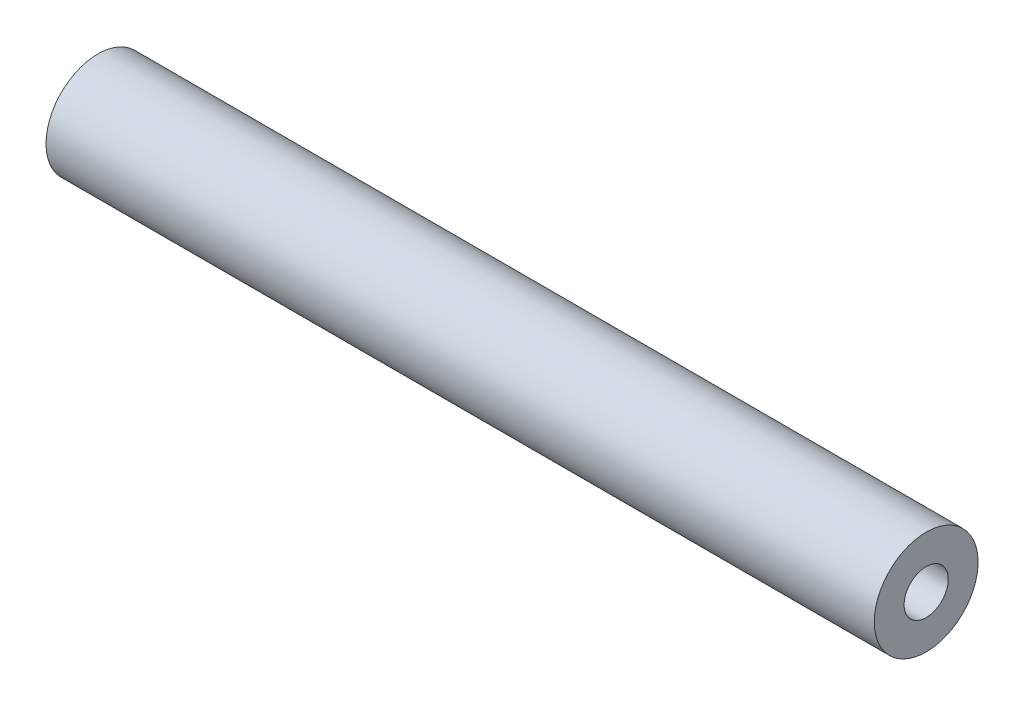
ISO-10303-21;
HEADER;
FILE_DESCRIPTION(('STEP AP214'),'2;1');
FILE_NAME('part.step','',(''),(''),'','','');
FILE_SCHEMA(('AUTOMOTIVE_DESIGN { 1 0 10303 214 1 1 1 1 }'));
ENDSEC;
DATA;
#1=APPLICATION_CONTEXT('core data for automotive mechanical design processes');
#2=APPLICATION_PROTOCOL_DEFINITION('international standard','automotive_design',2000,#1);
#3=PRODUCT_CONTEXT('',#1,'mechanical');
#4=PRODUCT('Part','Part','',(#3));
#5=PRODUCT_RELATED_PRODUCT_CATEGORY('part','',(#4));
#6=PRODUCT_DEFINITION_FORMATION('','',#4);
#7=PRODUCT_DEFINITION_CONTEXT('part definition',#1,'design');
#8=PRODUCT_DEFINITION('design','',#6,#7);
#9=PRODUCT_DEFINITION_SHAPE('','',#8);
#10=(LENGTH_UNIT() NAMED_UNIT(*) SI_UNIT(.MILLI.,.METRE.));
#11=(NAMED_UNIT(*) PLANE_ANGLE_UNIT() SI_UNIT($,.RADIAN.));
#12=(NAMED_UNIT(*) SI_UNIT($,.STERADIAN.) SOLID_ANGLE_UNIT());
#13=UNCERTAINTY_MEASURE_WITH_UNIT(LENGTH_MEASURE(1.E-05),#10,'distance_accuracy_value','');
#14=(GEOMETRIC_REPRESENTATION_CONTEXT(3) GLOBAL_UNCERTAINTY_ASSIGNED_CONTEXT((#13)) GLOBAL_UNIT_ASSIGNED_CONTEXT((#10,
#11,#12)) REPRESENTATION_CONTEXT('',''));
#15=CARTESIAN_POINT('',(0.,0.,0.));
#16=DIRECTION('',(0.,0.,1.));
#17=DIRECTION('',(1.,0.,0.));
#18=AXIS2_PLACEMENT_3D('',#15,#16,#17);
#19=CARTESIAN_POINT('',(0.,0.,-0.508));
#20=DIRECTION('',(1.,0.,0.));
#21=DIRECTION('',(0.,0.,-1.));
#22=AXIS2_PLACEMENT_3D('',#19,#20,#21);
#23=PLANE('',#22);
#24=CARTESIAN_POINT('',(0.,0.,0.));
#25=DIRECTION('',(-1.,0.,0.));
#26=DIRECTION('',(0.,0.,1.));
#27=AXIS2_PLACEMENT_3D('',#24,#25,#26);
#28=CIRCLE('',#27,0.508);
#29=CARTESIAN_POINT('',(0.,0.,0.508));
#30=VERTEX_POINT('',#29);
#31=EDGE_CURVE('E64',#30,#30,#28,.T.);
#32=ORIENTED_EDGE('',*,*,#31,.F.);
#33=EDGE_LOOP('',(#32));
#34=FACE_BOUND('',#33,.T.);
#35=CARTESIAN_POINT('',(0.,0.,0.));
#36=DIRECTION('',(-1.,0.,0.));
#37=DIRECTION('',(0.,0.,1.));
#38=AXIS2_PLACEMENT_3D('',#35,#36,#37);
#39=CIRCLE('',#38,1.1938);
#40=CARTESIAN_POINT('',(0.,0.,1.1938));
#41=VERTEX_POINT('',#40);
#42=EDGE_CURVE('E10',#41,#41,#39,.T.);
#43=ORIENTED_EDGE('',*,*,#42,.T.);
#44=EDGE_LOOP('',(#43));
#45=FACE_BOUND('',#44,.T.);
#46=ADVANCED_FACE('F47',(#34,#45),#23,.F.);
#47=CARTESIAN_POINT('',(0.,0.,0.));
#48=DIRECTION('',(-1.,0.,0.));
#49=DIRECTION('',(0.,0.,1.));
#50=AXIS2_PLACEMENT_3D('',#47,#48,#49);
#51=CYLINDRICAL_SURFACE('',#50,1.1938);
#52=ORIENTED_EDGE('',*,*,#42,.F.);
#53=EDGE_LOOP('',(#52));
#54=FACE_BOUND('',#53,.T.);
#55=CARTESIAN_POINT('',(19.05,0.,0.));
#56=DIRECTION('',(-1.,0.,0.));
#57=DIRECTION('',(0.,0.,1.));
#58=AXIS2_PLACEMENT_3D('',#55,#56,#57);
#59=CIRCLE('',#58,1.1938);
#60=CARTESIAN_POINT('',(19.05,0.,1.1938));
#61=VERTEX_POINT('',#60);
#62=EDGE_CURVE('E54',#61,#61,#59,.T.);
#63=ORIENTED_EDGE('',*,*,#62,.T.);
#64=EDGE_LOOP('',(#63));
#65=FACE_BOUND('',#64,.T.);
#66=ADVANCED_FACE('F74',(#54,#65),#51,.T.);
#67=CARTESIAN_POINT('',(19.05,0.,-0.508));
#68=DIRECTION('',(-1.,0.,0.));
#69=DIRECTION('',(0.,0.,1.));
#70=AXIS2_PLACEMENT_3D('',#67,#68,#69);
#71=PLANE('',#70);
#72=ORIENTED_EDGE('',*,*,#62,.F.);
#73=EDGE_LOOP('',(#72));
#74=FACE_BOUND('',#73,.T.);
#75=CARTESIAN_POINT('',(19.05,0.,0.));
#76=DIRECTION('',(-1.,0.,0.));
#77=DIRECTION('',(0.,0.,1.));
#78=AXIS2_PLACEMENT_3D('',#75,#76,#77);
#79=CIRCLE('',#78,0.508);
#80=CARTESIAN_POINT('',(19.05,0.,0.508));
#81=VERTEX_POINT('',#80);
#82=EDGE_CURVE('E59',#81,#81,#79,.T.);
#83=ORIENTED_EDGE('',*,*,#82,.T.);
#84=EDGE_LOOP('',(#83));
#85=FACE_BOUND('',#84,.T.);
#86=ADVANCED_FACE('F78',(#74,#85),#71,.F.);
#87=CARTESIAN_POINT('',(0.,0.,0.));
#88=DIRECTION('',(-1.,0.,0.));
#89=DIRECTION('',(0.,0.,1.));
#90=AXIS2_PLACEMENT_3D('',#87,#88,#89);
#91=CYLINDRICAL_SURFACE('',#90,0.508);
#92=ORIENTED_EDGE('',*,*,#82,.F.);
#93=EDGE_LOOP('',(#92));
#94=FACE_BOUND('',#93,.T.);
#95=ORIENTED_EDGE('',*,*,#31,.T.);
#96=EDGE_LOOP('',(#95));
#97=FACE_BOUND('',#96,.T.);
#98=ADVANCED_FACE('F71',(#94,#97),#91,.F.);
#99=CLOSED_SHELL('',(#46,#66,#86,#98));
#100=MANIFOLD_SOLID_BREP('B2',#99);
#101=ADVANCED_BREP_SHAPE_REPRESENTATION('',(#18,#100),#14);
#102=SHAPE_DEFINITION_REPRESENTATION(#9,#101);
ENDSEC;
END-ISO-10303-21;
